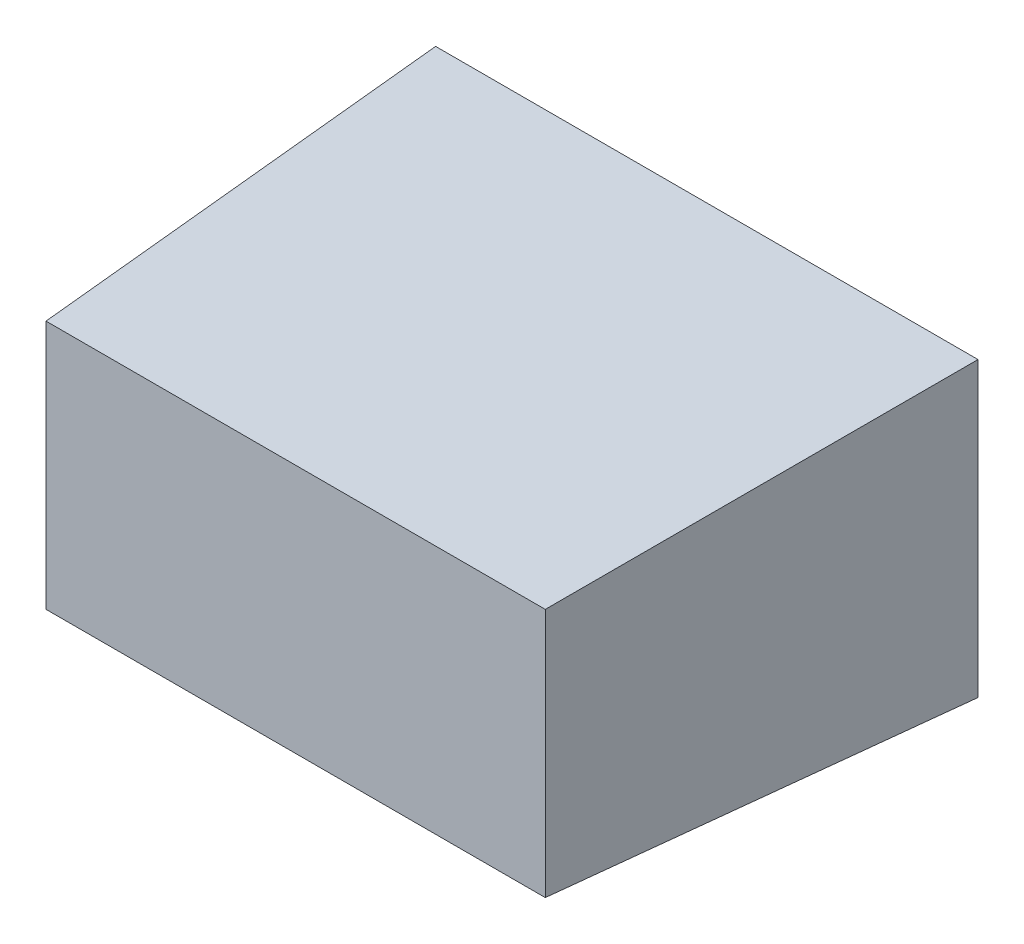
ISO-10303-21;
HEADER;
FILE_DESCRIPTION(('STEP AP214'),'2;1');
FILE_NAME('part.step','',(''),(''),'','','');
FILE_SCHEMA(('AUTOMOTIVE_DESIGN { 1 0 10303 214 1 1 1 1 }'));
ENDSEC;
DATA;
#1=APPLICATION_CONTEXT('core data for automotive mechanical design processes');
#2=APPLICATION_PROTOCOL_DEFINITION('international standard','automotive_design',2000,#1);
#3=PRODUCT_CONTEXT('',#1,'mechanical');
#4=PRODUCT('Part','Part','',(#3));
#5=PRODUCT_RELATED_PRODUCT_CATEGORY('part','',(#4));
#6=PRODUCT_DEFINITION_FORMATION('','',#4);
#7=PRODUCT_DEFINITION_CONTEXT('part definition',#1,'design');
#8=PRODUCT_DEFINITION('design','',#6,#7);
#9=PRODUCT_DEFINITION_SHAPE('','',#8);
#10=(LENGTH_UNIT() NAMED_UNIT(*) SI_UNIT(.MILLI.,.METRE.));
#11=(NAMED_UNIT(*) PLANE_ANGLE_UNIT() SI_UNIT($,.RADIAN.));
#12=(NAMED_UNIT(*) SI_UNIT($,.STERADIAN.) SOLID_ANGLE_UNIT());
#13=UNCERTAINTY_MEASURE_WITH_UNIT(LENGTH_MEASURE(1.E-05),#10,'distance_accuracy_value','');
#14=(GEOMETRIC_REPRESENTATION_CONTEXT(3) GLOBAL_UNCERTAINTY_ASSIGNED_CONTEXT((#13)) GLOBAL_UNIT_ASSIGNED_CONTEXT((#10,
#11,#12)) REPRESENTATION_CONTEXT('',''));
#15=CARTESIAN_POINT('',(0.,0.,0.));
#16=DIRECTION('',(0.,0.,1.));
#17=DIRECTION('',(1.,0.,0.));
#18=AXIS2_PLACEMENT_3D('',#15,#16,#17);
#19=CARTESIAN_POINT('',(0.,0.,0.));
#20=DIRECTION('',(0.,0.,1.));
#21=DIRECTION('',(1.,0.,0.));
#22=AXIS2_PLACEMENT_3D('',#19,#20,#21);
#23=PLANE('',#22);
#24=DIRECTION('',(0.,1.,0.));
#25=VECTOR('',#24,1.);
#26=CARTESIAN_POINT('',(-107.6770324424,0.,0.));
#27=LINE('',#26,#25);
#28=CARTESIAN_POINT('',(-107.6770324424,-45.6420938210593,0.));
#29=VERTEX_POINT('',#28);
#30=CARTESIAN_POINT('',(-107.6770324424,54.0320843781886,0.));
#31=VERTEX_POINT('',#30);
#32=EDGE_CURVE('E176',#29,#31,#27,.T.);
#33=ORIENTED_EDGE('',*,*,#32,.T.);
#34=DIRECTION('',(1.,0.,0.));
#35=VECTOR('',#34,1.);
#36=CARTESIAN_POINT('',(0.,54.0320843781887,0.));
#37=LINE('',#36,#35);
#38=CARTESIAN_POINT('',(76.9971457568478,54.0320843781886,0.));
#39=VERTEX_POINT('',#38);
#40=EDGE_CURVE('E11',#31,#39,#37,.T.);
#41=ORIENTED_EDGE('',*,*,#40,.T.);
#42=DIRECTION('',(0.,-1.,0.));
#43=VECTOR('',#42,1.);
#44=CARTESIAN_POINT('',(76.9971457568478,0.,0.));
#45=LINE('',#44,#43);
#46=CARTESIAN_POINT('',(76.9971457568478,-45.6420938210593,0.));
#47=VERTEX_POINT('',#46);
#48=EDGE_CURVE('E52',#39,#47,#45,.T.);
#49=ORIENTED_EDGE('',*,*,#48,.T.);
#50=DIRECTION('',(-1.,0.,0.));
#51=VECTOR('',#50,1.);
#52=CARTESIAN_POINT('',(0.,-45.6420938210593,0.));
#53=LINE('',#52,#51);
#54=EDGE_CURVE('E179',#47,#29,#53,.T.);
#55=ORIENTED_EDGE('',*,*,#54,.T.);
#56=EDGE_LOOP('',(#33,#41,#49,#55));
#57=FACE_BOUND('',#56,.T.);
#58=DIRECTION('',(0.,1.,0.));
#59=VECTOR('',#58,1.);
#60=CARTESIAN_POINT('',(-104.672915404406,0.,0.));
#61=LINE('',#60,#59);
#62=CARTESIAN_POINT('',(-104.672915404406,-42.6379767830655,0.));
#63=VERTEX_POINT('',#62);
#64=CARTESIAN_POINT('',(-104.672915404406,51.0279673401949,0.));
#65=VERTEX_POINT('',#64);
#66=EDGE_CURVE('E138',#63,#65,#61,.T.);
#67=ORIENTED_EDGE('',*,*,#66,.F.);
#68=DIRECTION('',(-1.,0.,0.));
#69=VECTOR('',#68,1.);
#70=CARTESIAN_POINT('',(0.,-42.6379767830655,0.));
#71=LINE('',#70,#69);
#72=CARTESIAN_POINT('',(73.993028718854,-42.6379767830655,0.));
#73=VERTEX_POINT('',#72);
#74=EDGE_CURVE('E141',#73,#63,#71,.T.);
#75=ORIENTED_EDGE('',*,*,#74,.F.);
#76=DIRECTION('',(0.,-1.,0.));
#77=VECTOR('',#76,1.);
#78=CARTESIAN_POINT('',(73.993028718854,0.,0.));
#79=LINE('',#78,#77);
#80=CARTESIAN_POINT('',(73.993028718854,51.0279673401949,0.));
#81=VERTEX_POINT('',#80);
#82=EDGE_CURVE('E156',#81,#73,#79,.T.);
#83=ORIENTED_EDGE('',*,*,#82,.F.);
#84=DIRECTION('',(1.,0.,0.));
#85=VECTOR('',#84,1.);
#86=CARTESIAN_POINT('',(0.,51.0279673401949,0.));
#87=LINE('',#86,#85);
#88=EDGE_CURVE('E128',#65,#81,#87,.T.);
#89=ORIENTED_EDGE('',*,*,#88,.F.);
#90=EDGE_LOOP('',(#67,#75,#83,#89));
#91=FACE_BOUND('',#90,.T.);
#92=ADVANCED_FACE('F41',(#57,#91),#23,.F.);
#93=CARTESIAN_POINT('',(0.,0.,140.));
#94=DIRECTION('',(0.,0.,1.));
#95=DIRECTION('',(1.,0.,0.));
#96=AXIS2_PLACEMENT_3D('',#93,#94,#95);
#97=PLANE('',#96);
#98=DIRECTION('',(0.,1.,0.));
#99=VECTOR('',#98,1.);
#100=CARTESIAN_POINT('',(69.6600566572225,56.6949952785647,140.));
#101=LINE('',#100,#99);
#102=CARTESIAN_POINT('',(69.6600566572225,-38.305004721434,140.));
#103=VERTEX_POINT('',#102);
#104=CARTESIAN_POINT('',(69.6600566572225,46.6949952785634,140.));
#105=VERTEX_POINT('',#104);
#106=EDGE_CURVE('E169',#103,#105,#101,.T.);
#107=ORIENTED_EDGE('',*,*,#106,.T.);
#108=DIRECTION('',(-1.,0.,0.));
#109=VECTOR('',#108,1.);
#110=CARTESIAN_POINT('',(-110.339943342776,46.6949952785634,140.));
#111=LINE('',#110,#109);
#112=CARTESIAN_POINT('',(-100.339943342775,46.6949952785634,140.));
#113=VERTEX_POINT('',#112);
#114=EDGE_CURVE('E172',#105,#113,#111,.T.);
#115=ORIENTED_EDGE('',*,*,#114,.T.);
#116=DIRECTION('',(0.,-1.,0.));
#117=VECTOR('',#116,1.);
#118=CARTESIAN_POINT('',(-100.339943342775,-48.3050047214353,140.));
#119=LINE('',#118,#117);
#120=CARTESIAN_POINT('',(-100.339943342775,-38.305004721434,140.));
#121=VERTEX_POINT('',#120);
#122=EDGE_CURVE('E163',#113,#121,#119,.T.);
#123=ORIENTED_EDGE('',*,*,#122,.T.);
#124=DIRECTION('',(1.,0.,0.));
#125=VECTOR('',#124,1.);
#126=CARTESIAN_POINT('',(79.6600566572238,-38.305004721434,140.));
#127=LINE('',#126,#125);
#128=EDGE_CURVE('E166',#121,#103,#127,.T.);
#129=ORIENTED_EDGE('',*,*,#128,.T.);
#130=EDGE_LOOP('',(#107,#115,#123,#129));
#131=FACE_BOUND('',#130,.T.);
#132=ADVANCED_FACE('F209',(#131),#97,.T.);
#133=CARTESIAN_POINT('',(0.,-38.305004721434,140.));
#134=DIRECTION('',(0.,-0.998629534754574,0.0523359562429406));
#135=DIRECTION('',(-1.,0.,0.));
#136=AXIS2_PLACEMENT_3D('',#133,#134,#135);
#137=PLANE('',#136);
#138=DIRECTION('',(0.0522644276887107,0.0522644276887107,0.997264688634238));
#139=VECTOR('',#138,1.);
#140=CARTESIAN_POINT('',(-100.235310525644,-38.2003719043026,141.996513085705));
#141=LINE('',#140,#139);
#142=EDGE_CURVE('E187',#29,#121,#141,.T.);
#143=ORIENTED_EDGE('',*,*,#142,.F.);
#144=ORIENTED_EDGE('',*,*,#54,.F.);
#145=DIRECTION('',(-0.0522644276887107,0.0522644276887107,0.997264688634238));
#146=VECTOR('',#145,1.);
#147=CARTESIAN_POINT('',(69.4697753082819,-38.1147233724933,143.630784428262));
#148=LINE('',#147,#146);
#149=EDGE_CURVE('E46',#103,#47,#148,.F.);
#150=ORIENTED_EDGE('',*,*,#149,.F.);
#151=ORIENTED_EDGE('',*,*,#128,.F.);
#152=EDGE_LOOP('',(#143,#144,#150,#151));
#153=FACE_BOUND('',#152,.T.);
#154=ADVANCED_FACE('F44',(#153),#137,.T.);
#155=CARTESIAN_POINT('',(69.6600566572225,0.,140.));
#156=DIRECTION('',(0.998629534754574,0.,0.0523359562429406));
#157=DIRECTION('',(0.,-1.,0.));
#158=AXIS2_PLACEMENT_3D('',#155,#156,#157);
#159=PLANE('',#158);
#160=ORIENTED_EDGE('',*,*,#149,.T.);
#161=ORIENTED_EDGE('',*,*,#48,.F.);
#162=DIRECTION('',(-0.0522644276887107,-0.0522644276887107,0.997264688634238));
#163=VECTOR('',#162,1.);
#164=CARTESIAN_POINT('',(69.5325059902154,46.5674446115562,142.433811711774));
#165=LINE('',#164,#163);
#166=EDGE_CURVE('E68',#105,#39,#165,.F.);
#167=ORIENTED_EDGE('',*,*,#166,.F.);
#168=ORIENTED_EDGE('',*,*,#106,.F.);
#169=EDGE_LOOP('',(#160,#161,#167,#168));
#170=FACE_BOUND('',#169,.T.);
#171=ADVANCED_FACE('F199',(#170),#159,.T.);
#172=CARTESIAN_POINT('',(-100.339943342775,0.,140.));
#173=DIRECTION('',(-0.998629534754574,0.,0.0523359562429406));
#174=DIRECTION('',(0.,1.,0.));
#175=AXIS2_PLACEMENT_3D('',#172,#173,#174);
#176=PLANE('',#175);
#177=ORIENTED_EDGE('',*,*,#142,.T.);
#178=ORIENTED_EDGE('',*,*,#122,.F.);
#179=DIRECTION('',(-0.0522644276887107,0.0522644276887107,-0.997264688634238));
#180=VECTOR('',#179,1.);
#181=CARTESIAN_POINT('',(-100.212392675768,46.5674446115562,142.433811711774));
#182=LINE('',#181,#180);
#183=EDGE_CURVE('E160',#31,#113,#182,.F.);
#184=ORIENTED_EDGE('',*,*,#183,.F.);
#185=ORIENTED_EDGE('',*,*,#32,.F.);
#186=EDGE_LOOP('',(#177,#178,#184,#185));
#187=FACE_BOUND('',#186,.T.);
#188=ADVANCED_FACE('F207',(#187),#176,.T.);
#189=CARTESIAN_POINT('',(0.,46.6949952785634,140.));
#190=DIRECTION('',(0.,0.998629534754574,0.0523359562429406));
#191=DIRECTION('',(1.,0.,0.));
#192=AXIS2_PLACEMENT_3D('',#189,#190,#191);
#193=PLANE('',#192);
#194=ORIENTED_EDGE('',*,*,#166,.T.);
#195=ORIENTED_EDGE('',*,*,#40,.F.);
#196=ORIENTED_EDGE('',*,*,#183,.T.);
#197=ORIENTED_EDGE('',*,*,#114,.F.);
#198=EDGE_LOOP('',(#194,#195,#196,#197));
#199=FACE_BOUND('',#198,.T.);
#200=ADVANCED_FACE('F206',(#199),#193,.T.);
#201=CARTESIAN_POINT('',(0.,0.,137.));
#202=DIRECTION('',(0.,0.,1.));
#203=DIRECTION('',(1.,0.,0.));
#204=AXIS2_PLACEMENT_3D('',#201,#202,#203);
#205=PLANE('',#204);
#206=DIRECTION('',(0.,1.,0.));
#207=VECTOR('',#206,1.);
#208=CARTESIAN_POINT('',(66.8131629570778,0.,137.));
#209=LINE('',#208,#207);
#210=CARTESIAN_POINT('',(66.8131629570779,-35.4581110212893,137.));
#211=VERTEX_POINT('',#210);
#212=CARTESIAN_POINT('',(66.8131629570778,43.8481015784187,137.));
#213=VERTEX_POINT('',#212);
#214=EDGE_CURVE('E111',#211,#213,#209,.T.);
#215=ORIENTED_EDGE('',*,*,#214,.F.);
#216=DIRECTION('',(1.,0.,0.));
#217=VECTOR('',#216,1.);
#218=CARTESIAN_POINT('',(0.,-35.4581110212893,137.));
#219=LINE('',#218,#217);
#220=CARTESIAN_POINT('',(-97.4930496426302,-35.4581110212893,137.));
#221=VERTEX_POINT('',#220);
#222=EDGE_CURVE('E121',#221,#211,#219,.T.);
#223=ORIENTED_EDGE('',*,*,#222,.F.);
#224=DIRECTION('',(0.,-1.,0.));
#225=VECTOR('',#224,1.);
#226=CARTESIAN_POINT('',(-97.4930496426302,0.,137.));
#227=LINE('',#226,#225);
#228=CARTESIAN_POINT('',(-97.4930496426302,43.8481015784187,137.));
#229=VERTEX_POINT('',#228);
#230=EDGE_CURVE('E136',#229,#221,#227,.T.);
#231=ORIENTED_EDGE('',*,*,#230,.F.);
#232=DIRECTION('',(-1.,0.,0.));
#233=VECTOR('',#232,1.);
#234=CARTESIAN_POINT('',(0.,43.8481015784187,137.));
#235=LINE('',#234,#233);
#236=EDGE_CURVE('E120',#213,#229,#235,.T.);
#237=ORIENTED_EDGE('',*,*,#236,.F.);
#238=EDGE_LOOP('',(#215,#223,#231,#237));
#239=FACE_BOUND('',#238,.T.);
#240=ADVANCED_FACE('F135',(#239),#205,.F.);
#241=CARTESIAN_POINT('',(0.,-35.3091161171702,139.842992131271));
#242=DIRECTION('',(0.,-0.998629534754574,0.0523359562429406));
#243=DIRECTION('',(-1.,0.,0.));
#244=AXIS2_PLACEMENT_3D('',#241,#242,#243);
#245=PLANE('',#244);
#246=DIRECTION('',(0.0522644276887107,0.0522644276887107,0.997264688634238));
#247=VECTOR('',#246,1.);
#248=CARTESIAN_POINT('',(-97.2476054020178,-35.2126667806769,141.683355104341));
#249=LINE('',#248,#247);
#250=EDGE_CURVE('E131',#63,#221,#249,.T.);
#251=ORIENTED_EDGE('',*,*,#250,.T.);
#252=ORIENTED_EDGE('',*,*,#222,.T.);
#253=DIRECTION('',(0.0522644276887107,-0.0522644276887107,-0.997264688634238));
#254=VECTOR('',#253,1.);
#255=CARTESIAN_POINT('',(66.5677187164654,-35.2126667806769,141.683355104341));
#256=LINE('',#255,#254);
#257=EDGE_CURVE('E60',#211,#73,#256,.T.);
#258=ORIENTED_EDGE('',*,*,#257,.T.);
#259=ORIENTED_EDGE('',*,*,#74,.T.);
#260=EDGE_LOOP('',(#251,#252,#258,#259));
#261=FACE_BOUND('',#260,.T.);
#262=ADVANCED_FACE('F252',(#261),#245,.F.);
#263=CARTESIAN_POINT('',(66.6641680529588,0.,139.842992131271));
#264=DIRECTION('',(0.998629534754574,0.,0.0523359562429406));
#265=DIRECTION('',(0.,-1.,0.));
#266=AXIS2_PLACEMENT_3D('',#263,#264,#265);
#267=PLANE('',#266);
#268=ORIENTED_EDGE('',*,*,#257,.F.);
#269=ORIENTED_EDGE('',*,*,#214,.T.);
#270=DIRECTION('',(0.0522644276887107,0.0522644276887107,-0.997264688634238));
#271=VECTOR('',#270,1.);
#272=CARTESIAN_POINT('',(66.4820701846561,43.517008805997,143.317626446898));
#273=LINE('',#272,#271);
#274=EDGE_CURVE('E114',#213,#81,#273,.T.);
#275=ORIENTED_EDGE('',*,*,#274,.T.);
#276=ORIENTED_EDGE('',*,*,#82,.T.);
#277=EDGE_LOOP('',(#268,#269,#275,#276));
#278=FACE_BOUND('',#277,.T.);
#279=ADVANCED_FACE('F113',(#278),#267,.F.);
#280=CARTESIAN_POINT('',(-97.3440547385111,0.,139.842992131271));
#281=DIRECTION('',(-0.998629534754574,0.,0.0523359562429406));
#282=DIRECTION('',(0.,1.,0.));
#283=AXIS2_PLACEMENT_3D('',#280,#281,#282);
#284=PLANE('',#283);
#285=ORIENTED_EDGE('',*,*,#250,.F.);
#286=ORIENTED_EDGE('',*,*,#66,.T.);
#287=DIRECTION('',(0.0522644276887107,-0.0522644276887107,0.997264688634238));
#288=VECTOR('',#287,1.);
#289=CARTESIAN_POINT('',(-97.0781525998129,43.4332045356014,144.916707185331));
#290=LINE('',#289,#288);
#291=EDGE_CURVE('E132',#65,#229,#290,.T.);
#292=ORIENTED_EDGE('',*,*,#291,.T.);
#293=ORIENTED_EDGE('',*,*,#230,.T.);
#294=EDGE_LOOP('',(#285,#286,#292,#293));
#295=FACE_BOUND('',#294,.T.);
#296=ADVANCED_FACE('F265',(#295),#284,.F.);
#297=CARTESIAN_POINT('',(0.,43.6991066742996,139.842992131271));
#298=DIRECTION('',(0.,0.998629534754574,0.0523359562429406));
#299=DIRECTION('',(1.,0.,0.));
#300=AXIS2_PLACEMENT_3D('',#297,#298,#299);
#301=PLANE('',#300);
#302=ORIENTED_EDGE('',*,*,#274,.F.);
#303=ORIENTED_EDGE('',*,*,#236,.T.);
#304=ORIENTED_EDGE('',*,*,#291,.F.);
#305=ORIENTED_EDGE('',*,*,#88,.T.);
#306=EDGE_LOOP('',(#302,#303,#304,#305));
#307=FACE_BOUND('',#306,.T.);
#308=ADVANCED_FACE('F125',(#307),#301,.F.);
#309=CLOSED_SHELL('',(#92,#132,#154,#171,#188,#200,#240,#262,#279,#296,#308));
#310=MANIFOLD_SOLID_BREP('B2',#309);
#311=ADVANCED_BREP_SHAPE_REPRESENTATION('',(#18,#310),#14);
#312=SHAPE_DEFINITION_REPRESENTATION(#9,#311);
ENDSEC;
END-ISO-10303-21;
